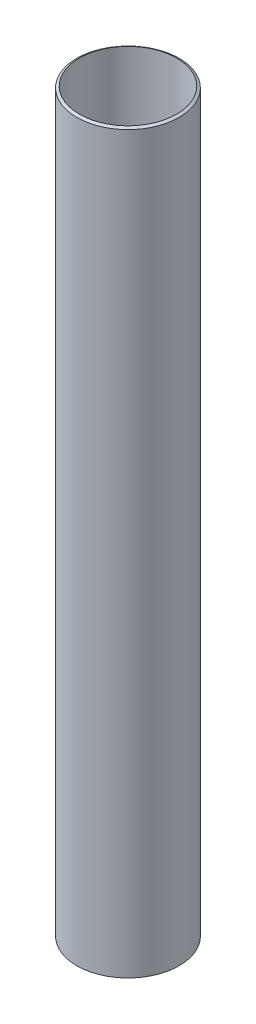
ISO-10303-21;
HEADER;
FILE_DESCRIPTION(('STEP AP214'),'2;1');
FILE_NAME('part.step','',(''),(''),'','','');
FILE_SCHEMA(('AUTOMOTIVE_DESIGN { 1 0 10303 214 1 1 1 1 }'));
ENDSEC;
DATA;
#1=APPLICATION_CONTEXT('core data for automotive mechanical design processes');
#2=APPLICATION_PROTOCOL_DEFINITION('international standard','automotive_design',2000,#1);
#3=PRODUCT_CONTEXT('',#1,'mechanical');
#4=PRODUCT('Part','Part','',(#3));
#5=PRODUCT_RELATED_PRODUCT_CATEGORY('part','',(#4));
#6=PRODUCT_DEFINITION_FORMATION('','',#4);
#7=PRODUCT_DEFINITION_CONTEXT('part definition',#1,'design');
#8=PRODUCT_DEFINITION('design','',#6,#7);
#9=PRODUCT_DEFINITION_SHAPE('','',#8);
#10=(LENGTH_UNIT() NAMED_UNIT(*) SI_UNIT(.MILLI.,.METRE.));
#11=(NAMED_UNIT(*) PLANE_ANGLE_UNIT() SI_UNIT($,.RADIAN.));
#12=(NAMED_UNIT(*) SI_UNIT($,.STERADIAN.) SOLID_ANGLE_UNIT());
#13=UNCERTAINTY_MEASURE_WITH_UNIT(LENGTH_MEASURE(1.E-05),#10,'distance_accuracy_value','');
#14=(GEOMETRIC_REPRESENTATION_CONTEXT(3) GLOBAL_UNCERTAINTY_ASSIGNED_CONTEXT((#13)) GLOBAL_UNIT_ASSIGNED_CONTEXT((#10,
#11,#12)) REPRESENTATION_CONTEXT('',''));
#15=CARTESIAN_POINT('',(0.,0.,0.));
#16=DIRECTION('',(0.,0.,1.));
#17=DIRECTION('',(1.,0.,0.));
#18=AXIS2_PLACEMENT_3D('',#15,#16,#17);
#19=CARTESIAN_POINT('',(0.,914.4,0.));
#20=DIRECTION('',(0.,-1.,0.));
#21=DIRECTION('',(0.,0.,-1.));
#22=AXIS2_PLACEMENT_3D('',#19,#20,#21);
#23=CONICAL_SURFACE('',#22,60.3250000000001,1.04719755119659);
#24=CARTESIAN_POINT('',(0.,912.566912895323,0.));
#25=DIRECTION('',(0.,1.,0.));
#26=DIRECTION('',(0.,0.,1.));
#27=AXIS2_PLACEMENT_3D('',#24,#25,#26);
#28=CIRCLE('',#27,63.5000000000001);
#29=CARTESIAN_POINT('',(0.,912.566912895323,63.5000000000001));
#30=VERTEX_POINT('',#29);
#31=EDGE_CURVE('E47',#30,#30,#28,.T.);
#32=ORIENTED_EDGE('',*,*,#31,.T.);
#33=EDGE_LOOP('',(#32));
#34=FACE_BOUND('',#33,.T.);
#35=CARTESIAN_POINT('',(0.,914.4,0.));
#36=DIRECTION('',(0.,1.,0.));
#37=DIRECTION('',(0.,0.,1.));
#38=AXIS2_PLACEMENT_3D('',#35,#36,#37);
#39=CIRCLE('',#38,60.3250000000001);
#40=CARTESIAN_POINT('',(0.,914.4,60.3250000000001));
#41=VERTEX_POINT('',#40);
#42=EDGE_CURVE('E10',#41,#41,#39,.T.);
#43=ORIENTED_EDGE('',*,*,#42,.F.);
#44=EDGE_LOOP('',(#43));
#45=FACE_BOUND('',#44,.T.);
#46=ADVANCED_FACE('F33',(#34,#45),#23,.T.);
#47=CARTESIAN_POINT('',(0.,819.187021794204,0.));
#48=DIRECTION('',(0.,1.,0.));
#49=DIRECTION('',(0.,0.,1.));
#50=AXIS2_PLACEMENT_3D('',#47,#48,#49);
#51=CYLINDRICAL_SURFACE('',#50,60.325);
#52=ORIENTED_EDGE('',*,*,#42,.T.);
#53=EDGE_LOOP('',(#52));
#54=FACE_BOUND('',#53,.T.);
#55=CARTESIAN_POINT('',(0.,0.,0.));
#56=DIRECTION('',(0.,1.,0.));
#57=DIRECTION('',(0.,0.,1.));
#58=AXIS2_PLACEMENT_3D('',#55,#56,#57);
#59=CIRCLE('',#58,60.325);
#60=CARTESIAN_POINT('',(0.,0.,60.325));
#61=VERTEX_POINT('',#60);
#62=EDGE_CURVE('E39',#61,#61,#59,.T.);
#63=ORIENTED_EDGE('',*,*,#62,.F.);
#64=EDGE_LOOP('',(#63));
#65=FACE_BOUND('',#64,.T.);
#66=ADVANCED_FACE('F63',(#54,#65),#51,.F.);
#67=CARTESIAN_POINT('',(0.,1.833087104677,0.));
#68=DIRECTION('',(0.,1.,0.));
#69=DIRECTION('',(0.,0.,1.));
#70=AXIS2_PLACEMENT_3D('',#67,#68,#69);
#71=CONICAL_SURFACE('',#70,63.5,1.04719755119661);
#72=ORIENTED_EDGE('',*,*,#62,.T.);
#73=EDGE_LOOP('',(#72));
#74=FACE_BOUND('',#73,.T.);
#75=CARTESIAN_POINT('',(0.,1.833087104677,0.));
#76=DIRECTION('',(0.,1.,0.));
#77=DIRECTION('',(0.,0.,1.));
#78=AXIS2_PLACEMENT_3D('',#75,#76,#77);
#79=CIRCLE('',#78,63.5);
#80=CARTESIAN_POINT('',(0.,1.833087104677,63.5));
#81=VERTEX_POINT('',#80);
#82=EDGE_CURVE('E43',#81,#81,#79,.T.);
#83=ORIENTED_EDGE('',*,*,#82,.F.);
#84=EDGE_LOOP('',(#83));
#85=FACE_BOUND('',#84,.T.);
#86=ADVANCED_FACE('F57',(#74,#85),#71,.T.);
#87=CARTESIAN_POINT('',(0.,819.187021794204,0.));
#88=DIRECTION('',(0.,1.,0.));
#89=DIRECTION('',(0.,0.,1.));
#90=AXIS2_PLACEMENT_3D('',#87,#88,#89);
#91=CYLINDRICAL_SURFACE('',#90,63.5);
#92=ORIENTED_EDGE('',*,*,#82,.T.);
#93=EDGE_LOOP('',(#92));
#94=FACE_BOUND('',#93,.T.);
#95=ORIENTED_EDGE('',*,*,#31,.F.);
#96=EDGE_LOOP('',(#95));
#97=FACE_BOUND('',#96,.T.);
#98=ADVANCED_FACE('F55',(#94,#97),#91,.T.);
#99=CLOSED_SHELL('',(#46,#66,#86,#98));
#100=MANIFOLD_SOLID_BREP('B2',#99);
#101=ADVANCED_BREP_SHAPE_REPRESENTATION('',(#18,#100),#14);
#102=SHAPE_DEFINITION_REPRESENTATION(#9,#101);
ENDSEC;
END-ISO-10303-21;
